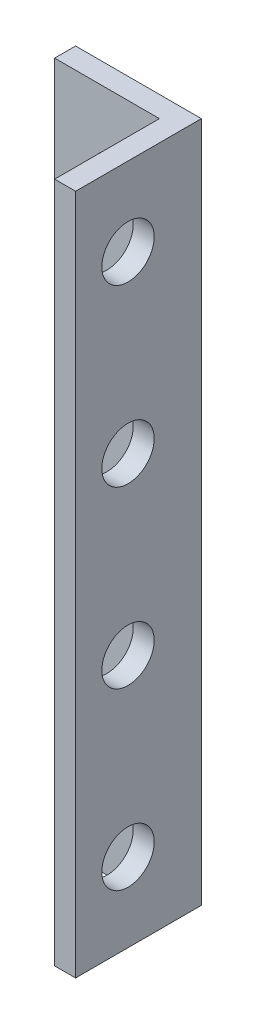
ISO-10303-21;
HEADER;
FILE_DESCRIPTION(('STEP AP214'),'2;1');
FILE_NAME('part.step','',(''),(''),'','','');
FILE_SCHEMA(('AUTOMOTIVE_DESIGN { 1 0 10303 214 1 1 1 1 }'));
ENDSEC;
DATA;
#1=APPLICATION_CONTEXT('core data for automotive mechanical design processes');
#2=APPLICATION_PROTOCOL_DEFINITION('international standard','automotive_design',2000,#1);
#3=PRODUCT_CONTEXT('',#1,'mechanical');
#4=PRODUCT('Part','Part','',(#3));
#5=PRODUCT_RELATED_PRODUCT_CATEGORY('part','',(#4));
#6=PRODUCT_DEFINITION_FORMATION('','',#4);
#7=PRODUCT_DEFINITION_CONTEXT('part definition',#1,'design');
#8=PRODUCT_DEFINITION('design','',#6,#7);
#9=PRODUCT_DEFINITION_SHAPE('','',#8);
#10=(LENGTH_UNIT() NAMED_UNIT(*) SI_UNIT(.MILLI.,.METRE.));
#11=(NAMED_UNIT(*) PLANE_ANGLE_UNIT() SI_UNIT($,.RADIAN.));
#12=(NAMED_UNIT(*) SI_UNIT($,.STERADIAN.) SOLID_ANGLE_UNIT());
#13=UNCERTAINTY_MEASURE_WITH_UNIT(LENGTH_MEASURE(1.E-05),#10,'distance_accuracy_value','');
#14=(GEOMETRIC_REPRESENTATION_CONTEXT(3) GLOBAL_UNCERTAINTY_ASSIGNED_CONTEXT((#13)) GLOBAL_UNIT_ASSIGNED_CONTEXT((#10,
#11,#12)) REPRESENTATION_CONTEXT('',''));
#15=CARTESIAN_POINT('',(0.,0.,0.));
#16=DIRECTION('',(0.,0.,1.));
#17=DIRECTION('',(1.,0.,0.));
#18=AXIS2_PLACEMENT_3D('',#15,#16,#17);
#19=CARTESIAN_POINT('',(0.,0.,1.2));
#20=DIRECTION('',(0.,0.,1.));
#21=DIRECTION('',(1.,0.,0.));
#22=AXIS2_PLACEMENT_3D('',#19,#20,#21);
#23=PLANE('',#22);
#24=DIRECTION('',(0.,-1.,0.));
#25=VECTOR('',#24,1.);
#26=CARTESIAN_POINT('',(2.4,19.5,1.2));
#27=LINE('',#26,#25);
#28=CARTESIAN_POINT('',(2.4,19.5,1.2));
#29=VERTEX_POINT('',#28);
#30=CARTESIAN_POINT('',(2.4,-19.5,1.2));
#31=VERTEX_POINT('',#30);
#32=EDGE_CURVE('E49',#29,#31,#27,.T.);
#33=ORIENTED_EDGE('',*,*,#32,.F.);
#34=DIRECTION('',(-1.,0.,0.));
#35=VECTOR('',#34,1.);
#36=CARTESIAN_POINT('',(3.6,19.5,1.2));
#37=LINE('',#36,#35);
#38=CARTESIAN_POINT('',(-3.6,19.5,1.2));
#39=VERTEX_POINT('',#38);
#40=EDGE_CURVE('E54',#29,#39,#37,.T.);
#41=ORIENTED_EDGE('',*,*,#40,.T.);
#42=DIRECTION('',(0.,-1.,0.));
#43=VECTOR('',#42,1.);
#44=CARTESIAN_POINT('',(-3.6,-19.5,1.2));
#45=LINE('',#44,#43);
#46=CARTESIAN_POINT('',(-3.6,-19.5,1.2));
#47=VERTEX_POINT('',#46);
#48=EDGE_CURVE('E85',#39,#47,#45,.T.);
#49=ORIENTED_EDGE('',*,*,#48,.T.);
#50=DIRECTION('',(1.,0.,0.));
#51=VECTOR('',#50,1.);
#52=CARTESIAN_POINT('',(3.6,-19.5,1.2));
#53=LINE('',#52,#51);
#54=EDGE_CURVE('E110',#47,#31,#53,.T.);
#55=ORIENTED_EDGE('',*,*,#54,.T.);
#56=EDGE_LOOP('',(#33,#41,#49,#55));
#57=FACE_BOUND('',#56,.T.);
#58=CARTESIAN_POINT('',(0.,15.,1.2));
#59=DIRECTION('',(0.,0.,1.));
#60=DIRECTION('',(-1.,0.,0.));
#61=AXIS2_PLACEMENT_3D('',#58,#59,#60);
#62=CIRCLE('',#61,1.5);
#63=CARTESIAN_POINT('',(-1.5,15.,1.2));
#64=VERTEX_POINT('',#63);
#65=EDGE_CURVE('E122',#64,#64,#62,.T.);
#66=ORIENTED_EDGE('',*,*,#65,.F.);
#67=EDGE_LOOP('',(#66));
#68=FACE_BOUND('',#67,.T.);
#69=CARTESIAN_POINT('',(0.,-4.99999999999999,1.2));
#70=DIRECTION('',(0.,0.,1.));
#71=DIRECTION('',(1.,0.,0.));
#72=AXIS2_PLACEMENT_3D('',#69,#70,#71);
#73=CIRCLE('',#72,1.5);
#74=CARTESIAN_POINT('',(1.5,-4.99999999999999,1.2));
#75=VERTEX_POINT('',#74);
#76=EDGE_CURVE('E96',#75,#75,#73,.T.);
#77=ORIENTED_EDGE('',*,*,#76,.F.);
#78=EDGE_LOOP('',(#77));
#79=FACE_BOUND('',#78,.T.);
#80=CARTESIAN_POINT('',(0.,-15.,1.2));
#81=DIRECTION('',(0.,0.,1.));
#82=DIRECTION('',(1.,0.,0.));
#83=AXIS2_PLACEMENT_3D('',#80,#81,#82);
#84=CIRCLE('',#83,1.5);
#85=CARTESIAN_POINT('',(1.5,-15.,1.2));
#86=VERTEX_POINT('',#85);
#87=EDGE_CURVE('E117',#86,#86,#84,.T.);
#88=ORIENTED_EDGE('',*,*,#87,.F.);
#89=EDGE_LOOP('',(#88));
#90=FACE_BOUND('',#89,.T.);
#91=CARTESIAN_POINT('',(0.,5.00000000000001,1.2));
#92=DIRECTION('',(0.,0.,1.));
#93=DIRECTION('',(-1.,0.,0.));
#94=AXIS2_PLACEMENT_3D('',#91,#92,#93);
#95=CIRCLE('',#94,1.5);
#96=CARTESIAN_POINT('',(-1.5,5.00000000000001,1.2));
#97=VERTEX_POINT('',#96);
#98=EDGE_CURVE('E128',#97,#97,#95,.T.);
#99=ORIENTED_EDGE('',*,*,#98,.F.);
#100=EDGE_LOOP('',(#99));
#101=FACE_BOUND('',#100,.T.);
#102=ADVANCED_FACE('F32',(#57,#68,#79,#90,#101),#23,.T.);
#103=CARTESIAN_POINT('',(0.,0.,0.));
#104=DIRECTION('',(0.,0.,1.));
#105=DIRECTION('',(1.,0.,0.));
#106=AXIS2_PLACEMENT_3D('',#103,#104,#105);
#107=PLANE('',#106);
#108=CARTESIAN_POINT('',(0.,15.,0.));
#109=DIRECTION('',(0.,0.,1.));
#110=DIRECTION('',(-1.,0.,0.));
#111=AXIS2_PLACEMENT_3D('',#108,#109,#110);
#112=CIRCLE('',#111,1.5);
#113=CARTESIAN_POINT('',(-1.5,15.,0.));
#114=VERTEX_POINT('',#113);
#115=EDGE_CURVE('E125',#114,#114,#112,.T.);
#116=ORIENTED_EDGE('',*,*,#115,.T.);
#117=EDGE_LOOP('',(#116));
#118=FACE_BOUND('',#117,.T.);
#119=CARTESIAN_POINT('',(0.,-4.99999999999999,0.));
#120=DIRECTION('',(0.,0.,1.));
#121=DIRECTION('',(1.,0.,0.));
#122=AXIS2_PLACEMENT_3D('',#119,#120,#121);
#123=CIRCLE('',#122,1.5);
#124=CARTESIAN_POINT('',(1.5,-4.99999999999999,0.));
#125=VERTEX_POINT('',#124);
#126=EDGE_CURVE('E100',#125,#125,#123,.T.);
#127=ORIENTED_EDGE('',*,*,#126,.T.);
#128=EDGE_LOOP('',(#127));
#129=FACE_BOUND('',#128,.T.);
#130=DIRECTION('',(0.,-1.,0.));
#131=VECTOR('',#130,1.);
#132=CARTESIAN_POINT('',(-3.6,-19.5,0.));
#133=LINE('',#132,#131);
#134=CARTESIAN_POINT('',(-3.6,19.5,0.));
#135=VERTEX_POINT('',#134);
#136=CARTESIAN_POINT('',(-3.6,-19.5,0.));
#137=VERTEX_POINT('',#136);
#138=EDGE_CURVE('E91',#135,#137,#133,.T.);
#139=ORIENTED_EDGE('',*,*,#138,.F.);
#140=DIRECTION('',(-1.,0.,0.));
#141=VECTOR('',#140,1.);
#142=CARTESIAN_POINT('',(3.6,19.5,0.));
#143=LINE('',#142,#141);
#144=CARTESIAN_POINT('',(3.6,19.5,0.));
#145=VERTEX_POINT('',#144);
#146=EDGE_CURVE('E74',#145,#135,#143,.T.);
#147=ORIENTED_EDGE('',*,*,#146,.F.);
#148=DIRECTION('',(0.,1.,0.));
#149=VECTOR('',#148,1.);
#150=CARTESIAN_POINT('',(3.6,-19.5,0.));
#151=LINE('',#150,#149);
#152=CARTESIAN_POINT('',(3.6,-19.5,0.));
#153=VERTEX_POINT('',#152);
#154=EDGE_CURVE('E86',#153,#145,#151,.T.);
#155=ORIENTED_EDGE('',*,*,#154,.F.);
#156=DIRECTION('',(1.,0.,0.));
#157=VECTOR('',#156,1.);
#158=CARTESIAN_POINT('',(3.6,-19.5,0.));
#159=LINE('',#158,#157);
#160=EDGE_CURVE('E95',#137,#153,#159,.T.);
#161=ORIENTED_EDGE('',*,*,#160,.F.);
#162=EDGE_LOOP('',(#139,#147,#155,#161));
#163=FACE_BOUND('',#162,.T.);
#164=CARTESIAN_POINT('',(0.,-15.,0.));
#165=DIRECTION('',(0.,0.,1.));
#166=DIRECTION('',(1.,0.,0.));
#167=AXIS2_PLACEMENT_3D('',#164,#165,#166);
#168=CIRCLE('',#167,1.5);
#169=CARTESIAN_POINT('',(1.5,-15.,0.));
#170=VERTEX_POINT('',#169);
#171=EDGE_CURVE('E119',#170,#170,#168,.T.);
#172=ORIENTED_EDGE('',*,*,#171,.T.);
#173=EDGE_LOOP('',(#172));
#174=FACE_BOUND('',#173,.T.);
#175=CARTESIAN_POINT('',(0.,5.00000000000001,0.));
#176=DIRECTION('',(0.,0.,1.));
#177=DIRECTION('',(-1.,0.,0.));
#178=AXIS2_PLACEMENT_3D('',#175,#176,#177);
#179=CIRCLE('',#178,1.5);
#180=CARTESIAN_POINT('',(-1.5,5.00000000000001,0.));
#181=VERTEX_POINT('',#180);
#182=EDGE_CURVE('E131',#181,#181,#179,.T.);
#183=ORIENTED_EDGE('',*,*,#182,.T.);
#184=EDGE_LOOP('',(#183));
#185=FACE_BOUND('',#184,.T.);
#186=ADVANCED_FACE('F93',(#118,#129,#163,#174,#185),#107,.F.);
#187=CARTESIAN_POINT('',(-3.6,-19.5,1.2));
#188=DIRECTION('',(1.,0.,0.));
#189=DIRECTION('',(0.,0.,-1.));
#190=AXIS2_PLACEMENT_3D('',#187,#188,#189);
#191=PLANE('',#190);
#192=ORIENTED_EDGE('',*,*,#138,.T.);
#193=DIRECTION('',(0.,0.,-1.));
#194=VECTOR('',#193,1.);
#195=CARTESIAN_POINT('',(-3.6,-19.5,1.2));
#196=LINE('',#195,#194);
#197=EDGE_CURVE('E11',#47,#137,#196,.T.);
#198=ORIENTED_EDGE('',*,*,#197,.F.);
#199=ORIENTED_EDGE('',*,*,#48,.F.);
#200=DIRECTION('',(0.,0.,-1.));
#201=VECTOR('',#200,1.);
#202=CARTESIAN_POINT('',(-3.6,19.5,1.2));
#203=LINE('',#202,#201);
#204=EDGE_CURVE('E77',#39,#135,#203,.T.);
#205=ORIENTED_EDGE('',*,*,#204,.T.);
#206=EDGE_LOOP('',(#192,#198,#199,#205));
#207=FACE_BOUND('',#206,.T.);
#208=ADVANCED_FACE('F34',(#207),#191,.F.);
#209=CARTESIAN_POINT('',(3.6,-19.5,1.2));
#210=DIRECTION('',(0.,1.,0.));
#211=DIRECTION('',(0.,0.,1.));
#212=AXIS2_PLACEMENT_3D('',#209,#210,#211);
#213=PLANE('',#212);
#214=ORIENTED_EDGE('',*,*,#160,.T.);
#215=DIRECTION('',(0.,0.,-1.));
#216=VECTOR('',#215,1.);
#217=CARTESIAN_POINT('',(3.6,-19.5,1.2));
#218=LINE('',#217,#216);
#219=CARTESIAN_POINT('',(3.6,-19.5,7.2));
#220=VERTEX_POINT('',#219);
#221=EDGE_CURVE('E41',#220,#153,#218,.T.);
#222=ORIENTED_EDGE('',*,*,#221,.F.);
#223=DIRECTION('',(1.,0.,0.));
#224=VECTOR('',#223,1.);
#225=CARTESIAN_POINT('',(3.6,-19.5,7.2));
#226=LINE('',#225,#224);
#227=CARTESIAN_POINT('',(2.4,-19.5,7.2));
#228=VERTEX_POINT('',#227);
#229=EDGE_CURVE('E139',#228,#220,#226,.T.);
#230=ORIENTED_EDGE('',*,*,#229,.F.);
#231=DIRECTION('',(0.,0.,-1.));
#232=VECTOR('',#231,1.);
#233=CARTESIAN_POINT('',(2.4,-19.5,7.2));
#234=LINE('',#233,#232);
#235=EDGE_CURVE('E144',#228,#31,#234,.T.);
#236=ORIENTED_EDGE('',*,*,#235,.T.);
#237=ORIENTED_EDGE('',*,*,#54,.F.);
#238=ORIENTED_EDGE('',*,*,#197,.T.);
#239=EDGE_LOOP('',(#214,#222,#230,#236,#237,#238));
#240=FACE_BOUND('',#239,.T.);
#241=ADVANCED_FACE('F171',(#240),#213,.F.);
#242=CARTESIAN_POINT('',(3.6,-19.5,1.2));
#243=DIRECTION('',(-1.,0.,0.));
#244=DIRECTION('',(0.,0.,1.));
#245=AXIS2_PLACEMENT_3D('',#242,#243,#244);
#246=PLANE('',#245);
#247=CARTESIAN_POINT('',(3.6,-15.,4.2));
#248=DIRECTION('',(-1.,0.,0.));
#249=DIRECTION('',(0.,0.,1.));
#250=AXIS2_PLACEMENT_3D('',#247,#248,#249);
#251=CIRCLE('',#250,1.5);
#252=CARTESIAN_POINT('',(3.6,-15.,5.7));
#253=VERTEX_POINT('',#252);
#254=EDGE_CURVE('E195',#253,#253,#251,.F.);
#255=ORIENTED_EDGE('',*,*,#254,.F.);
#256=EDGE_LOOP('',(#255));
#257=FACE_BOUND('',#256,.T.);
#258=CARTESIAN_POINT('',(3.6,-4.99999999999999,4.2));
#259=DIRECTION('',(-1.,0.,0.));
#260=DIRECTION('',(0.,0.,1.));
#261=AXIS2_PLACEMENT_3D('',#258,#259,#260);
#262=CIRCLE('',#261,1.5);
#263=CARTESIAN_POINT('',(3.6,-4.99999999999999,5.7));
#264=VERTEX_POINT('',#263);
#265=EDGE_CURVE('E189',#264,#264,#262,.F.);
#266=ORIENTED_EDGE('',*,*,#265,.F.);
#267=EDGE_LOOP('',(#266));
#268=FACE_BOUND('',#267,.T.);
#269=CARTESIAN_POINT('',(3.6,5.00000000000001,4.2));
#270=DIRECTION('',(-1.,0.,0.));
#271=DIRECTION('',(0.,0.,1.));
#272=AXIS2_PLACEMENT_3D('',#269,#270,#271);
#273=CIRCLE('',#272,1.5);
#274=CARTESIAN_POINT('',(3.6,5.00000000000001,5.7));
#275=VERTEX_POINT('',#274);
#276=EDGE_CURVE('E183',#275,#275,#273,.F.);
#277=ORIENTED_EDGE('',*,*,#276,.F.);
#278=EDGE_LOOP('',(#277));
#279=FACE_BOUND('',#278,.T.);
#280=CARTESIAN_POINT('',(3.6,15.,4.2));
#281=DIRECTION('',(-1.,0.,0.));
#282=DIRECTION('',(0.,0.,1.));
#283=AXIS2_PLACEMENT_3D('',#280,#281,#282);
#284=CIRCLE('',#283,1.5);
#285=CARTESIAN_POINT('',(3.6,15.,5.7));
#286=VERTEX_POINT('',#285);
#287=EDGE_CURVE('E143',#286,#286,#284,.F.);
#288=ORIENTED_EDGE('',*,*,#287,.F.);
#289=EDGE_LOOP('',(#288));
#290=FACE_BOUND('',#289,.T.);
#291=ORIENTED_EDGE('',*,*,#154,.T.);
#292=DIRECTION('',(0.,0.,-1.));
#293=VECTOR('',#292,1.);
#294=CARTESIAN_POINT('',(3.6,19.5,1.2));
#295=LINE('',#294,#293);
#296=CARTESIAN_POINT('',(3.6,19.5,7.2));
#297=VERTEX_POINT('',#296);
#298=EDGE_CURVE('E81',#297,#145,#295,.T.);
#299=ORIENTED_EDGE('',*,*,#298,.F.);
#300=DIRECTION('',(0.,1.,0.));
#301=VECTOR('',#300,1.);
#302=CARTESIAN_POINT('',(3.6,19.5,7.2));
#303=LINE('',#302,#301);
#304=EDGE_CURVE('E142',#220,#297,#303,.T.);
#305=ORIENTED_EDGE('',*,*,#304,.F.);
#306=ORIENTED_EDGE('',*,*,#221,.T.);
#307=EDGE_LOOP('',(#291,#299,#305,#306));
#308=FACE_BOUND('',#307,.T.);
#309=ADVANCED_FACE('F223',(#257,#268,#279,#290,#308),#246,.F.);
#310=CARTESIAN_POINT('',(3.6,19.5,1.2));
#311=DIRECTION('',(0.,-1.,0.));
#312=DIRECTION('',(0.,0.,-1.));
#313=AXIS2_PLACEMENT_3D('',#310,#311,#312);
#314=PLANE('',#313);
#315=ORIENTED_EDGE('',*,*,#146,.T.);
#316=ORIENTED_EDGE('',*,*,#204,.F.);
#317=ORIENTED_EDGE('',*,*,#40,.F.);
#318=DIRECTION('',(0.,0.,-1.));
#319=VECTOR('',#318,1.);
#320=CARTESIAN_POINT('',(2.4,19.5,7.2));
#321=LINE('',#320,#319);
#322=CARTESIAN_POINT('',(2.4,19.5,7.2));
#323=VERTEX_POINT('',#322);
#324=EDGE_CURVE('E134',#323,#29,#321,.T.);
#325=ORIENTED_EDGE('',*,*,#324,.F.);
#326=DIRECTION('',(-1.,0.,0.));
#327=VECTOR('',#326,1.);
#328=CARTESIAN_POINT('',(3.6,19.5,7.2));
#329=LINE('',#328,#327);
#330=EDGE_CURVE('E160',#297,#323,#329,.T.);
#331=ORIENTED_EDGE('',*,*,#330,.F.);
#332=ORIENTED_EDGE('',*,*,#298,.T.);
#333=EDGE_LOOP('',(#315,#316,#317,#325,#331,#332));
#334=FACE_BOUND('',#333,.T.);
#335=ADVANCED_FACE('F76',(#334),#314,.F.);
#336=CARTESIAN_POINT('',(0.,-4.99999999999999,1.2));
#337=DIRECTION('',(0.,0.,-1.));
#338=DIRECTION('',(-1.,0.,0.));
#339=AXIS2_PLACEMENT_3D('',#336,#337,#338);
#340=CYLINDRICAL_SURFACE('',#339,1.5);
#341=ORIENTED_EDGE('',*,*,#76,.T.);
#342=EDGE_LOOP('',(#341));
#343=FACE_BOUND('',#342,.T.);
#344=ORIENTED_EDGE('',*,*,#126,.F.);
#345=EDGE_LOOP('',(#344));
#346=FACE_BOUND('',#345,.T.);
#347=ADVANCED_FACE('F240',(#343,#346),#340,.F.);
#348=CARTESIAN_POINT('',(0.,-15.,1.2));
#349=DIRECTION('',(0.,0.,-1.));
#350=DIRECTION('',(-1.,0.,0.));
#351=AXIS2_PLACEMENT_3D('',#348,#349,#350);
#352=CYLINDRICAL_SURFACE('',#351,1.5);
#353=ORIENTED_EDGE('',*,*,#87,.T.);
#354=EDGE_LOOP('',(#353));
#355=FACE_BOUND('',#354,.T.);
#356=ORIENTED_EDGE('',*,*,#171,.F.);
#357=EDGE_LOOP('',(#356));
#358=FACE_BOUND('',#357,.T.);
#359=ADVANCED_FACE('F291',(#355,#358),#352,.F.);
#360=CARTESIAN_POINT('',(0.,15.,1.2));
#361=DIRECTION('',(0.,0.,-1.));
#362=DIRECTION('',(-1.,0.,0.));
#363=AXIS2_PLACEMENT_3D('',#360,#361,#362);
#364=CYLINDRICAL_SURFACE('',#363,1.5);
#365=ORIENTED_EDGE('',*,*,#65,.T.);
#366=EDGE_LOOP('',(#365));
#367=FACE_BOUND('',#366,.T.);
#368=ORIENTED_EDGE('',*,*,#115,.F.);
#369=EDGE_LOOP('',(#368));
#370=FACE_BOUND('',#369,.T.);
#371=ADVANCED_FACE('F299',(#367,#370),#364,.F.);
#372=CARTESIAN_POINT('',(0.,5.00000000000001,1.2));
#373=DIRECTION('',(0.,0.,-1.));
#374=DIRECTION('',(-1.,0.,0.));
#375=AXIS2_PLACEMENT_3D('',#372,#373,#374);
#376=CYLINDRICAL_SURFACE('',#375,1.5);
#377=ORIENTED_EDGE('',*,*,#98,.T.);
#378=EDGE_LOOP('',(#377));
#379=FACE_BOUND('',#378,.T.);
#380=ORIENTED_EDGE('',*,*,#182,.F.);
#381=EDGE_LOOP('',(#380));
#382=FACE_BOUND('',#381,.T.);
#383=ADVANCED_FACE('F208',(#379,#382),#376,.F.);
#384=CARTESIAN_POINT('',(2.4,19.5,7.2));
#385=DIRECTION('',(1.,0.,0.));
#386=DIRECTION('',(0.,1.,0.));
#387=AXIS2_PLACEMENT_3D('',#384,#385,#386);
#388=PLANE('',#387);
#389=CARTESIAN_POINT('',(2.4,-15.,4.2));
#390=DIRECTION('',(-1.,0.,0.));
#391=DIRECTION('',(0.,1.,0.));
#392=AXIS2_PLACEMENT_3D('',#389,#390,#391);
#393=CIRCLE('',#392,1.5);
#394=CARTESIAN_POINT('',(2.4,-13.5,4.2));
#395=VERTEX_POINT('',#394);
#396=EDGE_CURVE('E198',#395,#395,#393,.T.);
#397=ORIENTED_EDGE('',*,*,#396,.F.);
#398=EDGE_LOOP('',(#397));
#399=FACE_BOUND('',#398,.T.);
#400=CARTESIAN_POINT('',(2.4,-4.99999999999999,4.2));
#401=DIRECTION('',(-1.,0.,0.));
#402=DIRECTION('',(0.,1.,0.));
#403=AXIS2_PLACEMENT_3D('',#400,#401,#402);
#404=CIRCLE('',#403,1.5);
#405=CARTESIAN_POINT('',(2.4,-3.49999999999999,4.2));
#406=VERTEX_POINT('',#405);
#407=EDGE_CURVE('E192',#406,#406,#404,.T.);
#408=ORIENTED_EDGE('',*,*,#407,.F.);
#409=EDGE_LOOP('',(#408));
#410=FACE_BOUND('',#409,.T.);
#411=CARTESIAN_POINT('',(2.4,5.00000000000001,4.2));
#412=DIRECTION('',(-1.,0.,0.));
#413=DIRECTION('',(0.,-1.,0.));
#414=AXIS2_PLACEMENT_3D('',#411,#412,#413);
#415=CIRCLE('',#414,1.5);
#416=CARTESIAN_POINT('',(2.4,3.50000000000001,4.2));
#417=VERTEX_POINT('',#416);
#418=EDGE_CURVE('E186',#417,#417,#415,.T.);
#419=ORIENTED_EDGE('',*,*,#418,.F.);
#420=EDGE_LOOP('',(#419));
#421=FACE_BOUND('',#420,.T.);
#422=CARTESIAN_POINT('',(2.4,15.,4.2));
#423=DIRECTION('',(-1.,0.,0.));
#424=DIRECTION('',(0.,-1.,0.));
#425=AXIS2_PLACEMENT_3D('',#422,#423,#424);
#426=CIRCLE('',#425,1.5);
#427=CARTESIAN_POINT('',(2.4,13.5,4.2));
#428=VERTEX_POINT('',#427);
#429=EDGE_CURVE('E180',#428,#428,#426,.T.);
#430=ORIENTED_EDGE('',*,*,#429,.F.);
#431=EDGE_LOOP('',(#430));
#432=FACE_BOUND('',#431,.T.);
#433=ORIENTED_EDGE('',*,*,#32,.T.);
#434=ORIENTED_EDGE('',*,*,#235,.F.);
#435=DIRECTION('',(0.,-1.,0.));
#436=VECTOR('',#435,1.);
#437=CARTESIAN_POINT('',(2.4,19.5,7.2));
#438=LINE('',#437,#436);
#439=EDGE_CURVE('E157',#323,#228,#438,.T.);
#440=ORIENTED_EDGE('',*,*,#439,.F.);
#441=ORIENTED_EDGE('',*,*,#324,.T.);
#442=EDGE_LOOP('',(#433,#434,#440,#441));
#443=FACE_BOUND('',#442,.T.);
#444=ADVANCED_FACE('F152',(#399,#410,#421,#432,#443),#388,.F.);
#445=CARTESIAN_POINT('',(0.,0.,7.2));
#446=DIRECTION('',(0.,0.,-1.));
#447=DIRECTION('',(-1.,0.,0.));
#448=AXIS2_PLACEMENT_3D('',#445,#446,#447);
#449=PLANE('',#448);
#450=ORIENTED_EDGE('',*,*,#304,.T.);
#451=ORIENTED_EDGE('',*,*,#330,.T.);
#452=ORIENTED_EDGE('',*,*,#439,.T.);
#453=ORIENTED_EDGE('',*,*,#229,.T.);
#454=EDGE_LOOP('',(#450,#451,#452,#453));
#455=FACE_BOUND('',#454,.T.);
#456=ADVANCED_FACE('F207',(#455),#449,.F.);
#457=CARTESIAN_POINT('',(3.601,15.,4.2));
#458=DIRECTION('',(-1.,0.,0.));
#459=DIRECTION('',(0.,-1.,0.));
#460=AXIS2_PLACEMENT_3D('',#457,#458,#459);
#461=CYLINDRICAL_SURFACE('',#460,1.5);
#462=ORIENTED_EDGE('',*,*,#429,.T.);
#463=EDGE_LOOP('',(#462));
#464=FACE_BOUND('',#463,.T.);
#465=ORIENTED_EDGE('',*,*,#287,.T.);
#466=EDGE_LOOP('',(#465));
#467=FACE_BOUND('',#466,.T.);
#468=ADVANCED_FACE('F216',(#464,#467),#461,.F.);
#469=CARTESIAN_POINT('',(3.601,5.00000000000001,4.2));
#470=DIRECTION('',(-1.,0.,0.));
#471=DIRECTION('',(0.,-1.,0.));
#472=AXIS2_PLACEMENT_3D('',#469,#470,#471);
#473=CYLINDRICAL_SURFACE('',#472,1.5);
#474=ORIENTED_EDGE('',*,*,#418,.T.);
#475=EDGE_LOOP('',(#474));
#476=FACE_BOUND('',#475,.T.);
#477=ORIENTED_EDGE('',*,*,#276,.T.);
#478=EDGE_LOOP('',(#477));
#479=FACE_BOUND('',#478,.T.);
#480=ADVANCED_FACE('F219',(#476,#479),#473,.F.);
#481=CARTESIAN_POINT('',(3.601,-4.99999999999999,4.2));
#482=DIRECTION('',(-1.,0.,0.));
#483=DIRECTION('',(0.,-1.,0.));
#484=AXIS2_PLACEMENT_3D('',#481,#482,#483);
#485=CYLINDRICAL_SURFACE('',#484,1.5);
#486=ORIENTED_EDGE('',*,*,#407,.T.);
#487=EDGE_LOOP('',(#486));
#488=FACE_BOUND('',#487,.T.);
#489=ORIENTED_EDGE('',*,*,#265,.T.);
#490=EDGE_LOOP('',(#489));
#491=FACE_BOUND('',#490,.T.);
#492=ADVANCED_FACE('F343',(#488,#491),#485,.F.);
#493=CARTESIAN_POINT('',(3.601,-15.,4.2));
#494=DIRECTION('',(-1.,0.,0.));
#495=DIRECTION('',(0.,-1.,0.));
#496=AXIS2_PLACEMENT_3D('',#493,#494,#495);
#497=CYLINDRICAL_SURFACE('',#496,1.5);
#498=ORIENTED_EDGE('',*,*,#396,.T.);
#499=EDGE_LOOP('',(#498));
#500=FACE_BOUND('',#499,.T.);
#501=ORIENTED_EDGE('',*,*,#254,.T.);
#502=EDGE_LOOP('',(#501));
#503=FACE_BOUND('',#502,.T.);
#504=ADVANCED_FACE('F202',(#500,#503),#497,.F.);
#505=CLOSED_SHELL('',(#102,#186,#208,#241,#309,#335,#347,#359,#371,#383,#444,#456,#468,#480,
#492,#504));
#506=MANIFOLD_SOLID_BREP('B2',#505);
#507=ADVANCED_BREP_SHAPE_REPRESENTATION('',(#18,#506),#14);
#508=SHAPE_DEFINITION_REPRESENTATION(#9,#507);
ENDSEC;
END-ISO-10303-21;
